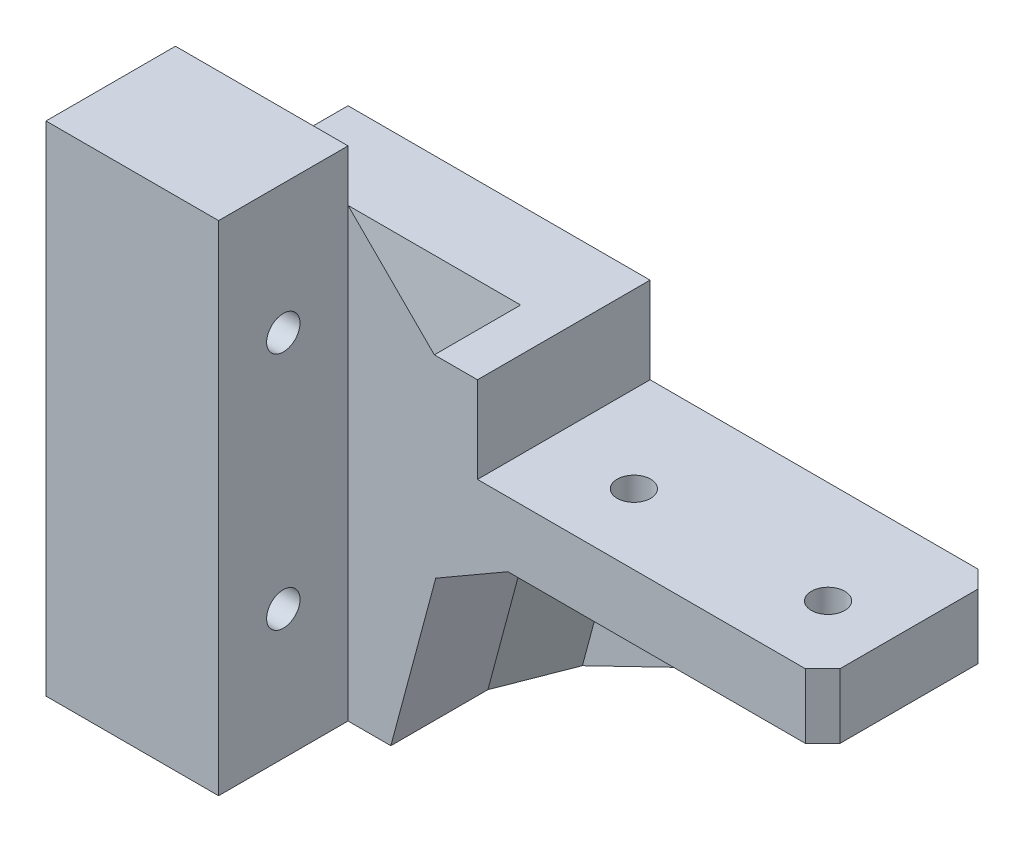
ISO-10303-21;
HEADER;
FILE_DESCRIPTION(('STEP AP214'),'2;1');
FILE_NAME('part.step','',(''),(''),'','','');
FILE_SCHEMA(('AUTOMOTIVE_DESIGN { 1 0 10303 214 1 1 1 1 }'));
ENDSEC;
DATA;
#1=APPLICATION_CONTEXT('core data for automotive mechanical design processes');
#2=APPLICATION_PROTOCOL_DEFINITION('international standard','automotive_design',2000,#1);
#3=PRODUCT_CONTEXT('',#1,'mechanical');
#4=PRODUCT('Part','Part','',(#3));
#5=PRODUCT_RELATED_PRODUCT_CATEGORY('part','',(#4));
#6=PRODUCT_DEFINITION_FORMATION('','',#4);
#7=PRODUCT_DEFINITION_CONTEXT('part definition',#1,'design');
#8=PRODUCT_DEFINITION('design','',#6,#7);
#9=PRODUCT_DEFINITION_SHAPE('','',#8);
#10=(LENGTH_UNIT() NAMED_UNIT(*) SI_UNIT(.MILLI.,.METRE.));
#11=(NAMED_UNIT(*) PLANE_ANGLE_UNIT() SI_UNIT($,.RADIAN.));
#12=(NAMED_UNIT(*) SI_UNIT($,.STERADIAN.) SOLID_ANGLE_UNIT());
#13=UNCERTAINTY_MEASURE_WITH_UNIT(LENGTH_MEASURE(1.E-05),#10,'distance_accuracy_value','');
#14=(GEOMETRIC_REPRESENTATION_CONTEXT(3) GLOBAL_UNCERTAINTY_ASSIGNED_CONTEXT((#13)) GLOBAL_UNIT_ASSIGNED_CONTEXT((#10,
#11,#12)) REPRESENTATION_CONTEXT('',''));
#15=CARTESIAN_POINT('',(0.,0.,0.));
#16=DIRECTION('',(0.,0.,1.));
#17=DIRECTION('',(1.,0.,0.));
#18=AXIS2_PLACEMENT_3D('',#15,#16,#17);
#19=CARTESIAN_POINT('',(95.2499999999948,-202.564999999986,-33.3374999999997));
#20=DIRECTION('',(0.,0.707106781186555,-0.707106781186544));
#21=DIRECTION('',(1.,0.,0.));
#22=AXIS2_PLACEMENT_3D('',#19,#20,#21);
#23=PLANE('',#22);
#24=CARTESIAN_POINT('',(85.7250000000001,-198.596249999989,-29.3687499999997));
#25=DIRECTION('',(0.,0.707106781186555,-0.707106781186544));
#26=DIRECTION('',(0.,0.707106781186547,0.707106781186554));
#27=AXIS2_PLACEMENT_3D('',#24,#25,#26);
#28=ELLIPSE('',#27,8.9802561210691,6.35);
#29=CARTESIAN_POINT('',(90.6819671612285,-202.564999999988,-33.3374999999996));
#30=VERTEX_POINT('',#29);
#31=CARTESIAN_POINT('',(80.7680328387726,-202.564999999991,-33.3374999999997));
#32=VERTEX_POINT('',#31);
#33=EDGE_CURVE('E173',#30,#32,#28,.T.);
#34=ORIENTED_EDGE('',*,*,#33,.T.);
#35=DIRECTION('',(1.,0.,0.));
#36=VECTOR('',#35,1.);
#37=CARTESIAN_POINT('',(95.2499999999948,-202.564999999986,-33.3374999999997));
#38=LINE('',#37,#36);
#39=CARTESIAN_POINT('',(62.1069671612249,-202.564999999988,-33.3374999999996));
#40=VERTEX_POINT('',#39);
#41=EDGE_CURVE('E180',#40,#32,#38,.T.);
#42=ORIENTED_EDGE('',*,*,#41,.F.);
#43=CARTESIAN_POINT('',(57.1499999999992,-198.596249999991,-29.3687499999997));
#44=DIRECTION('',(0.,0.707106781186555,-0.707106781186544));
#45=DIRECTION('',(0.,0.707106781186547,0.707106781186554));
#46=AXIS2_PLACEMENT_3D('',#43,#44,#45);
#47=ELLIPSE('',#46,8.98025612106912,6.35000000000001);
#48=CARTESIAN_POINT('',(52.1930328387673,-202.564999999983,-33.3374999999996));
#49=VERTEX_POINT('',#48);
#50=EDGE_CURVE('E394',#40,#49,#47,.T.);
#51=ORIENTED_EDGE('',*,*,#50,.T.);
#52=CARTESIAN_POINT('',(48.9302561210705,-202.564999999988,-33.3374999999997));
#53=VERTEX_POINT('',#52);
#54=EDGE_CURVE('E186',#53,#49,#38,.T.);
#55=ORIENTED_EDGE('',*,*,#54,.F.);
#56=DIRECTION('',(0.41596662095865,0.643028681416404,0.643028681416411));
#57=VECTOR('',#56,1.);
#58=CARTESIAN_POINT('',(48.9302561210705,-202.564999999988,-33.3374999999997));
#59=LINE('',#58,#57);
#60=CARTESIAN_POINT('',(44.8225263736655,-208.914999999988,-39.6875));
#61=VERTEX_POINT('',#60);
#62=EDGE_CURVE('E212',#61,#53,#59,.T.);
#63=ORIENTED_EDGE('',*,*,#62,.F.);
#64=DIRECTION('',(-1.,0.,0.));
#65=VECTOR('',#64,1.);
#66=CARTESIAN_POINT('',(0.,-208.914999999988,-39.6875));
#67=LINE('',#66,#65);
#68=CARTESIAN_POINT('',(82.1464607723961,-208.914999999991,-39.6875));
#69=VERTEX_POINT('',#68);
#70=EDGE_CURVE('E199',#69,#61,#67,.T.);
#71=ORIENTED_EDGE('',*,*,#70,.F.);
#72=DIRECTION('',(-0.824876446835016,-0.399736692997303,-0.399736692997308));
#73=VECTOR('',#72,1.);
#74=CARTESIAN_POINT('',(95.2499999999948,-202.564999999986,-33.3374999999997));
#75=LINE('',#74,#73);
#76=CARTESIAN_POINT('',(95.2499999999948,-202.564999999986,-33.3374999999997));
#77=VERTEX_POINT('',#76);
#78=EDGE_CURVE('E11',#77,#69,#75,.T.);
#79=ORIENTED_EDGE('',*,*,#78,.F.);
#80=EDGE_CURVE('E182',#30,#77,#38,.T.);
#81=ORIENTED_EDGE('',*,*,#80,.F.);
#82=EDGE_LOOP('',(#34,#42,#51,#55,#63,#71,#79,#81));
#83=FACE_BOUND('',#82,.T.);
#84=ADVANCED_FACE('F34',(#83),#23,.F.);
#85=CARTESIAN_POINT('',(25.399999999995,-160.055836743416,-44.4499999999994));
#86=DIRECTION('',(0.,1.,0.));
#87=DIRECTION('',(0.,0.,1.));
#88=AXIS2_PLACEMENT_3D('',#85,#86,#87);
#89=PLANE('',#88);
#90=DIRECTION('',(0.,0.,1.));
#91=VECTOR('',#90,1.);
#92=CARTESIAN_POINT('',(25.399999999995,-160.055836743416,-44.4499999999994));
#93=LINE('',#92,#91);
#94=CARTESIAN_POINT('',(25.399999999995,-160.055836743416,-19.0499999999992));
#95=VERTEX_POINT('',#94);
#96=CARTESIAN_POINT('',(25.399999999995,-160.055836743416,4.16333634234434E-13));
#97=VERTEX_POINT('',#96);
#98=EDGE_CURVE('E319',#95,#97,#93,.T.);
#99=ORIENTED_EDGE('',*,*,#98,.F.);
#100=DIRECTION('',(-1.,0.,0.));
#101=VECTOR('',#100,1.);
#102=CARTESIAN_POINT('',(60.3249999999998,-160.055836743416,-19.0499999999999));
#103=LINE('',#102,#101);
#104=CARTESIAN_POINT('',(-7.105427357601E-12,-160.055836743414,-19.0500000000001));
#105=VERTEX_POINT('',#104);
#106=EDGE_CURVE('E359',#95,#105,#103,.T.);
#107=ORIENTED_EDGE('',*,*,#106,.T.);
#108=DIRECTION('',(0.,0.,1.));
#109=VECTOR('',#108,1.);
#110=CARTESIAN_POINT('',(-7.99360577730113E-12,-160.055836743415,-44.4500000000002));
#111=LINE('',#110,#109);
#112=CARTESIAN_POINT('',(-7.06379399417756E-12,-160.055836743414,-1.2490009027033E-13));
#113=VERTEX_POINT('',#112);
#114=EDGE_CURVE('E317',#105,#113,#111,.T.);
#115=ORIENTED_EDGE('',*,*,#114,.T.);
#116=DIRECTION('',(-1.,0.,0.));
#117=VECTOR('',#116,1.);
#118=CARTESIAN_POINT('',(25.399999999995,-160.055836743416,4.16333634234434E-13));
#119=LINE('',#118,#117);
#120=EDGE_CURVE('E302',#97,#113,#119,.T.);
#121=ORIENTED_EDGE('',*,*,#120,.F.);
#122=EDGE_LOOP('',(#99,#107,#115,#121));
#123=FACE_BOUND('',#122,.T.);
#124=ADVANCED_FACE('F444',(#123),#89,.T.);
#125=CARTESIAN_POINT('',(31.6978347460993,-233.362499999999,-19.0499999999997));
#126=DIRECTION('',(0.965925826289074,-0.258819045102523,0.));
#127=DIRECTION('',(0.258819045102522,0.965925826289074,0.));
#128=AXIS2_PLACEMENT_3D('',#125,#126,#127);
#129=PLANE('',#128);
#130=DIRECTION('',(0.258819045102522,0.965925826289074,0.));
#131=VECTOR('',#130,1.);
#132=CARTESIAN_POINT('',(31.6978347460993,-233.362499999999,-33.3374999999997));
#133=LINE('',#132,#131);
#134=CARTESIAN_POINT('',(31.6978347460993,-233.362499999999,-33.3374999999997));
#135=VERTEX_POINT('',#134);
#136=CARTESIAN_POINT('',(38.3064990635998,-208.698628996924,-33.3374999999999));
#137=VERTEX_POINT('',#136);
#138=EDGE_CURVE('E195',#135,#137,#133,.T.);
#139=ORIENTED_EDGE('',*,*,#138,.T.);
#140=DIRECTION('',(0.,0.,1.));
#141=VECTOR('',#140,1.);
#142=CARTESIAN_POINT('',(38.3064990635998,-208.698628996924,-19.0499999999997));
#143=LINE('',#142,#141);
#144=CARTESIAN_POINT('',(38.3064990635998,-208.698628996924,-19.0499999999997));
#145=VERTEX_POINT('',#144);
#146=EDGE_CURVE('E197',#137,#145,#143,.T.);
#147=ORIENTED_EDGE('',*,*,#146,.T.);
#148=DIRECTION('',(-0.258819045102522,-0.965925826289069,0.));
#149=VECTOR('',#148,1.);
#150=CARTESIAN_POINT('',(31.6978347460993,-233.362499999999,-19.0499999999997));
#151=LINE('',#150,#149);
#152=CARTESIAN_POINT('',(31.6978347460993,-233.362499999999,-19.0499999999997));
#153=VERTEX_POINT('',#152);
#154=EDGE_CURVE('E349',#145,#153,#151,.T.);
#155=ORIENTED_EDGE('',*,*,#154,.T.);
#156=DIRECTION('',(0.,0.,-1.));
#157=VECTOR('',#156,1.);
#158=CARTESIAN_POINT('',(31.6978347460993,-233.362499999999,-19.0499999999997));
#159=LINE('',#158,#157);
#160=EDGE_CURVE('E290',#153,#135,#159,.T.);
#161=ORIENTED_EDGE('',*,*,#160,.T.);
#162=EDGE_LOOP('',(#139,#147,#155,#161));
#163=FACE_BOUND('',#162,.T.);
#164=ADVANCED_FACE('F448',(#163),#129,.T.);
#165=CARTESIAN_POINT('',(95.2499999999948,-202.564999999986,-19.0499999999997));
#166=DIRECTION('',(0.,-1.,0.));
#167=DIRECTION('',(0.,0.,-1.));
#168=AXIS2_PLACEMENT_3D('',#165,#166,#167);
#169=PLANE('',#168);
#170=CARTESIAN_POINT('',(85.7249999999983,-202.564999999991,-29.3687499999997));
#171=DIRECTION('',(0.,-1.,0.));
#172=DIRECTION('',(0.,0.,-1.));
#173=AXIS2_PLACEMENT_3D('',#170,#171,#172);
#174=CIRCLE('',#173,2.45744999999999);
#175=CARTESIAN_POINT('',(85.7249999999983,-202.564999999991,-31.8261999999997));
#176=VERTEX_POINT('',#175);
#177=EDGE_CURVE('E175',#176,#176,#174,.T.);
#178=ORIENTED_EDGE('',*,*,#177,.F.);
#179=EDGE_LOOP('',(#178));
#180=FACE_BOUND('',#179,.T.);
#181=CARTESIAN_POINT('',(57.1499999999992,-202.564999999992,-29.3687499999997));
#182=DIRECTION('',(0.,-1.,0.));
#183=DIRECTION('',(0.,0.,-1.));
#184=AXIS2_PLACEMENT_3D('',#181,#182,#183);
#185=CIRCLE('',#184,2.45744999999999);
#186=CARTESIAN_POINT('',(57.1499999999992,-202.564999999992,-31.8261999999996));
#187=VERTEX_POINT('',#186);
#188=EDGE_CURVE('E388',#187,#187,#185,.T.);
#189=ORIENTED_EDGE('',*,*,#188,.F.);
#190=EDGE_LOOP('',(#189));
#191=FACE_BOUND('',#190,.T.);
#192=DIRECTION('',(-1.,0.,0.));
#193=VECTOR('',#192,1.);
#194=CARTESIAN_POINT('',(95.2499999999948,-202.564999999986,-19.0499999999997));
#195=LINE('',#194,#193);
#196=CARTESIAN_POINT('',(92.7100000000003,-202.564999999989,-19.0499999999997));
#197=VERTEX_POINT('',#196);
#198=CARTESIAN_POINT('',(48.9302561210705,-202.564999999988,-19.0499999999997));
#199=VERTEX_POINT('',#198);
#200=EDGE_CURVE('E270',#197,#199,#195,.T.);
#201=ORIENTED_EDGE('',*,*,#200,.T.);
#202=DIRECTION('',(0.,0.,-1.));
#203=VECTOR('',#202,1.);
#204=CARTESIAN_POINT('',(48.9302561210705,-202.564999999988,-39.6874999999997));
#205=LINE('',#204,#203);
#206=EDGE_CURVE('E188',#199,#53,#205,.T.);
#207=ORIENTED_EDGE('',*,*,#206,.T.);
#208=ORIENTED_EDGE('',*,*,#54,.T.);
#209=CARTESIAN_POINT('',(57.1499999999992,-202.564999999992,-29.3687499999997));
#210=DIRECTION('',(0.,-1.,0.));
#211=DIRECTION('',(0.,0.,-1.));
#212=AXIS2_PLACEMENT_3D('',#209,#210,#211);
#213=CIRCLE('',#212,6.35000000000001);
#214=EDGE_CURVE('E56',#49,#40,#213,.T.);
#215=ORIENTED_EDGE('',*,*,#214,.T.);
#216=ORIENTED_EDGE('',*,*,#41,.T.);
#217=CARTESIAN_POINT('',(85.7249999999983,-202.564999999991,-29.3687499999997));
#218=DIRECTION('',(0.,-1.,0.));
#219=DIRECTION('',(0.,0.,-1.));
#220=AXIS2_PLACEMENT_3D('',#217,#218,#219);
#221=CIRCLE('',#220,6.35);
#222=EDGE_CURVE('E50',#32,#30,#221,.T.);
#223=ORIENTED_EDGE('',*,*,#222,.T.);
#224=ORIENTED_EDGE('',*,*,#80,.T.);
#225=DIRECTION('',(0.,0.,-1.));
#226=VECTOR('',#225,1.);
#227=CARTESIAN_POINT('',(95.2499999999948,-202.564999999986,-19.0499999999997));
#228=LINE('',#227,#226);
#229=CARTESIAN_POINT('',(95.2499999999948,-202.564999999986,-21.5899999999997));
#230=VERTEX_POINT('',#229);
#231=EDGE_CURVE('E287',#230,#77,#228,.T.);
#232=ORIENTED_EDGE('',*,*,#231,.F.);
#233=DIRECTION('',(-0.707106781186551,0.,0.707106781186546));
#234=VECTOR('',#233,1.);
#235=CARTESIAN_POINT('',(93.9800000000002,-202.564999999989,-20.3199999999996));
#236=LINE('',#235,#234);
#237=EDGE_CURVE('E259',#230,#197,#236,.T.);
#238=ORIENTED_EDGE('',*,*,#237,.T.);
#239=EDGE_LOOP('',(#201,#207,#208,#215,#216,#223,#224,#232,#238));
#240=FACE_BOUND('',#239,.T.);
#241=ADVANCED_FACE('F185',(#180,#191,#240),#169,.T.);
#242=CARTESIAN_POINT('',(25.399999999995,-160.055836743416,-44.4499999999994));
#243=DIRECTION('',(1.,0.,0.));
#244=DIRECTION('',(0.,1.00000000000001,0.));
#245=AXIS2_PLACEMENT_3D('',#242,#243,#244);
#246=PLANE('',#245);
#247=CARTESIAN_POINT('',(25.3999999999968,-214.312500000006,-9.52499999999992));
#248=DIRECTION('',(1.,0.,0.));
#249=DIRECTION('',(0.,1.00000000000001,0.));
#250=AXIS2_PLACEMENT_3D('',#247,#248,#249);
#251=CIRCLE('',#250,2.45744999999999);
#252=CARTESIAN_POINT('',(25.3999999999968,-211.855050000006,-9.52499999999992));
#253=VERTEX_POINT('',#252);
#254=EDGE_CURVE('E220',#253,#253,#251,.T.);
#255=ORIENTED_EDGE('',*,*,#254,.F.);
#256=EDGE_LOOP('',(#255));
#257=FACE_BOUND('',#256,.T.);
#258=CARTESIAN_POINT('',(25.3999999999977,-179.105836743419,-9.52499999999973));
#259=DIRECTION('',(1.,0.,0.));
#260=DIRECTION('',(0.,1.00000000000001,0.));
#261=AXIS2_PLACEMENT_3D('',#258,#259,#260);
#262=CIRCLE('',#261,2.45744999999999);
#263=CARTESIAN_POINT('',(25.3999999999977,-176.648386743419,-9.52499999999973));
#264=VERTEX_POINT('',#263);
#265=EDGE_CURVE('E383',#264,#264,#262,.T.);
#266=ORIENTED_EDGE('',*,*,#265,.F.);
#267=EDGE_LOOP('',(#266));
#268=FACE_BOUND('',#267,.T.);
#269=DIRECTION('',(0.,1.00000000000001,0.));
#270=VECTOR('',#269,1.);
#271=CARTESIAN_POINT('',(25.4000000000012,-233.3625,-19.0499999999999));
#272=LINE('',#271,#270);
#273=CARTESIAN_POINT('',(25.4000000000012,-233.3625,-19.0499999999999));
#274=VERTEX_POINT('',#273);
#275=CARTESIAN_POINT('',(25.4000000000004,-167.639999999989,-19.0499999999996));
#276=VERTEX_POINT('',#275);
#277=EDGE_CURVE('E343',#274,#276,#272,.T.);
#278=ORIENTED_EDGE('',*,*,#277,.T.);
#279=EDGE_CURVE('E345',#276,#95,#272,.T.);
#280=ORIENTED_EDGE('',*,*,#279,.T.);
#281=ORIENTED_EDGE('',*,*,#98,.T.);
#282=DIRECTION('',(0.,1.00000000000001,0.));
#283=VECTOR('',#282,1.);
#284=CARTESIAN_POINT('',(25.399999999995,-160.055836743416,4.16333634234434E-13));
#285=LINE('',#284,#283);
#286=CARTESIAN_POINT('',(25.4000000000003,-233.362500000002,1.80411241501588E-13));
#287=VERTEX_POINT('',#286);
#288=EDGE_CURVE('E312',#287,#97,#285,.T.);
#289=ORIENTED_EDGE('',*,*,#288,.F.);
#290=DIRECTION('',(0.,0.,1.));
#291=VECTOR('',#290,1.);
#292=CARTESIAN_POINT('',(25.4000000000013,-233.3625,-44.4499999999999));
#293=LINE('',#292,#291);
#294=EDGE_CURVE('E321',#274,#287,#293,.T.);
#295=ORIENTED_EDGE('',*,*,#294,.F.);
#296=EDGE_LOOP('',(#278,#280,#281,#289,#295));
#297=FACE_BOUND('',#296,.T.);
#298=ADVANCED_FACE('F461',(#257,#268,#297),#246,.T.);
#299=CARTESIAN_POINT('',(-7.99360577730113E-12,-160.055836743415,-44.4500000000002));
#300=DIRECTION('',(-1.,0.,0.));
#301=DIRECTION('',(0.,-1.,0.));
#302=AXIS2_PLACEMENT_3D('',#299,#300,#301);
#303=PLANE('',#302);
#304=CARTESIAN_POINT('',(0.,-179.105836743417,-9.52499999999958));
#305=DIRECTION('',(-1.,0.,0.));
#306=DIRECTION('',(0.,0.,1.));
#307=AXIS2_PLACEMENT_3D('',#304,#305,#306);
#308=CIRCLE('',#307,2.95910000000002);
#309=CARTESIAN_POINT('',(0.,-179.105836743417,-6.56589999999955));
#310=VERTEX_POINT('',#309);
#311=EDGE_CURVE('E380',#310,#310,#308,.T.);
#312=ORIENTED_EDGE('',*,*,#311,.F.);
#313=EDGE_LOOP('',(#312));
#314=FACE_BOUND('',#313,.T.);
#315=CARTESIAN_POINT('',(-8.18789480661053E-13,-214.312500000005,-9.52499999999992));
#316=DIRECTION('',(-1.,0.,0.));
#317=DIRECTION('',(0.,0.,1.));
#318=AXIS2_PLACEMENT_3D('',#315,#316,#317);
#319=CIRCLE('',#318,2.95910000000002);
#320=CARTESIAN_POINT('',(-8.18132428470619E-13,-214.312500000005,-6.5658999999999));
#321=VERTEX_POINT('',#320);
#322=EDGE_CURVE('E374',#321,#321,#319,.T.);
#323=ORIENTED_EDGE('',*,*,#322,.F.);
#324=EDGE_LOOP('',(#323));
#325=FACE_BOUND('',#324,.T.);
#326=DIRECTION('',(0.,-1.,0.));
#327=VECTOR('',#326,1.);
#328=CARTESIAN_POINT('',(-7.04991620636974E-12,-180.339999999986,-19.0499999999997));
#329=LINE('',#328,#327);
#330=CARTESIAN_POINT('',(-3.52495810318487E-12,-167.639999999986,-19.05));
#331=VERTEX_POINT('',#330);
#332=EDGE_CURVE('E364',#105,#331,#329,.T.);
#333=ORIENTED_EDGE('',*,*,#332,.T.);
#334=DIRECTION('',(0.,-0.707106781186547,-0.707106781186552));
#335=VECTOR('',#334,1.);
#336=CARTESIAN_POINT('',(-7.06379399417756E-12,-180.339999999986,-31.7499999999999));
#337=LINE('',#336,#335);
#338=CARTESIAN_POINT('',(-7.07767178198537E-12,-180.339999999986,-31.7499999999998));
#339=VERTEX_POINT('',#338);
#340=EDGE_CURVE('E235',#331,#339,#337,.T.);
#341=ORIENTED_EDGE('',*,*,#340,.T.);
#342=DIRECTION('',(0.,0.,-1.));
#343=VECTOR('',#342,1.);
#344=CARTESIAN_POINT('',(-7.06379399417756E-12,-180.339999999986,44.5939541827765));
#345=LINE('',#344,#343);
#346=CARTESIAN_POINT('',(-7.07767178198537E-12,-180.339999999986,-44.4499999999998));
#347=VERTEX_POINT('',#346);
#348=EDGE_CURVE('E362',#339,#347,#345,.T.);
#349=ORIENTED_EDGE('',*,*,#348,.T.);
#350=DIRECTION('',(0.,-1.,0.));
#351=VECTOR('',#350,1.);
#352=CARTESIAN_POINT('',(-7.99360577730113E-12,-160.055836743415,-44.4500000000002));
#353=LINE('',#352,#351);
#354=CARTESIAN_POINT('',(0.,-233.3625,-44.4499999999998));
#355=VERTEX_POINT('',#354);
#356=EDGE_CURVE('E299',#347,#355,#353,.T.);
#357=ORIENTED_EDGE('',*,*,#356,.T.);
#358=DIRECTION('',(0.,0.,1.));
#359=VECTOR('',#358,1.);
#360=CARTESIAN_POINT('',(0.,-233.3625,-44.4499999999998));
#361=LINE('',#360,#359);
#362=CARTESIAN_POINT('',(0.,-233.3625,2.91433543964104E-13));
#363=VERTEX_POINT('',#362);
#364=EDGE_CURVE('E305',#355,#363,#361,.T.);
#365=ORIENTED_EDGE('',*,*,#364,.T.);
#366=DIRECTION('',(0.,-1.,0.));
#367=VECTOR('',#366,1.);
#368=CARTESIAN_POINT('',(-7.06379399417756E-12,-160.055836743414,-1.2490009027033E-13));
#369=LINE('',#368,#367);
#370=EDGE_CURVE('E306',#113,#363,#369,.T.);
#371=ORIENTED_EDGE('',*,*,#370,.F.);
#372=ORIENTED_EDGE('',*,*,#114,.F.);
#373=EDGE_LOOP('',(#333,#341,#349,#357,#365,#371,#372));
#374=FACE_BOUND('',#373,.T.);
#375=ADVANCED_FACE('F464',(#314,#325,#374),#303,.T.);
#376=CARTESIAN_POINT('',(25.4000000000013,-233.3625,-44.4499999999999));
#377=DIRECTION('',(0.,-1.,0.));
#378=DIRECTION('',(0.,0.,-1.));
#379=AXIS2_PLACEMENT_3D('',#376,#377,#378);
#380=PLANE('',#379);
#381=DIRECTION('',(1.,0.,0.));
#382=VECTOR('',#381,1.);
#383=CARTESIAN_POINT('',(25.4000000000003,-233.362500000002,1.80411241501588E-13));
#384=LINE('',#383,#382);
#385=EDGE_CURVE('E309',#363,#287,#384,.T.);
#386=ORIENTED_EDGE('',*,*,#385,.F.);
#387=ORIENTED_EDGE('',*,*,#364,.F.);
#388=DIRECTION('',(1.,0.,0.));
#389=VECTOR('',#388,1.);
#390=CARTESIAN_POINT('',(25.4000000000013,-233.3625,-44.4499999999999));
#391=LINE('',#390,#389);
#392=CARTESIAN_POINT('',(31.6978347460993,-233.362499999999,-44.4499999999998));
#393=VERTEX_POINT('',#392);
#394=EDGE_CURVE('E301',#355,#393,#391,.T.);
#395=ORIENTED_EDGE('',*,*,#394,.T.);
#396=DIRECTION('',(0.,0.,-1.));
#397=VECTOR('',#396,1.);
#398=CARTESIAN_POINT('',(31.6978347460993,-233.362499999999,-39.6874999999998));
#399=LINE('',#398,#397);
#400=EDGE_CURVE('E352',#135,#393,#399,.T.);
#401=ORIENTED_EDGE('',*,*,#400,.F.);
#402=ORIENTED_EDGE('',*,*,#160,.F.);
#403=DIRECTION('',(-1.,0.,0.));
#404=VECTOR('',#403,1.);
#405=CARTESIAN_POINT('',(25.4000000000012,-233.3625,-19.0499999999999));
#406=LINE('',#405,#404);
#407=EDGE_CURVE('E346',#153,#274,#406,.T.);
#408=ORIENTED_EDGE('',*,*,#407,.T.);
#409=ORIENTED_EDGE('',*,*,#294,.T.);
#410=EDGE_LOOP('',(#386,#387,#395,#401,#402,#408,#409));
#411=FACE_BOUND('',#410,.T.);
#412=ADVANCED_FACE('F466',(#411),#380,.T.);
#413=CARTESIAN_POINT('',(0.,0.,-44.45));
#414=DIRECTION('',(0.,0.,-1.));
#415=DIRECTION('',(-1.,0.,0.));
#416=AXIS2_PLACEMENT_3D('',#413,#414,#415);
#417=PLANE('',#416);
#418=DIRECTION('',(1.,0.,0.));
#419=VECTOR('',#418,1.);
#420=CARTESIAN_POINT('',(44.4500000000004,-193.039999999989,-44.4499999999997));
#421=LINE('',#420,#419);
#422=CARTESIAN_POINT('',(44.4500000000004,-193.039999999989,-44.4499999999997));
#423=VERTEX_POINT('',#422);
#424=CARTESIAN_POINT('',(92.7099999999995,-193.039999999988,-44.4499999999997));
#425=VERTEX_POINT('',#424);
#426=EDGE_CURVE('E338',#423,#425,#421,.T.);
#427=ORIENTED_EDGE('',*,*,#426,.T.);
#428=DIRECTION('',(0.,-1.,0.));
#429=VECTOR('',#428,1.);
#430=CARTESIAN_POINT('',(92.7099999999995,1.66533453693773E-13,-44.4499999999994));
#431=LINE('',#430,#429);
#432=CARTESIAN_POINT('',(92.7100000000004,-203.795888824745,-44.4499999999998));
#433=VERTEX_POINT('',#432);
#434=EDGE_CURVE('E246',#425,#433,#431,.T.);
#435=ORIENTED_EDGE('',*,*,#434,.T.);
#436=DIRECTION('',(-0.89990120040365,-0.436093831086931,0.));
#437=VECTOR('',#436,1.);
#438=CARTESIAN_POINT('',(31.6978347460993,-233.362499999999,-44.4499999999998));
#439=LINE('',#438,#437);
#440=EDGE_CURVE('E357',#433,#393,#439,.T.);
#441=ORIENTED_EDGE('',*,*,#440,.T.);
#442=ORIENTED_EDGE('',*,*,#394,.F.);
#443=ORIENTED_EDGE('',*,*,#356,.F.);
#444=DIRECTION('',(-1.,0.,0.));
#445=VECTOR('',#444,1.);
#446=CARTESIAN_POINT('',(60.3249999999971,-180.339999999987,-44.4499999999998));
#447=LINE('',#446,#445);
#448=CARTESIAN_POINT('',(44.4499999999986,-180.339999999986,-44.4499999999997));
#449=VERTEX_POINT('',#448);
#450=EDGE_CURVE('E365',#449,#347,#447,.T.);
#451=ORIENTED_EDGE('',*,*,#450,.F.);
#452=DIRECTION('',(0.,-1.,0.));
#453=VECTOR('',#452,1.);
#454=CARTESIAN_POINT('',(44.4500000000004,-193.039999999989,-44.4499999999997));
#455=LINE('',#454,#453);
#456=EDGE_CURVE('E279',#449,#423,#455,.T.);
#457=ORIENTED_EDGE('',*,*,#456,.T.);
#458=EDGE_LOOP('',(#427,#435,#441,#442,#443,#451,#457));
#459=FACE_BOUND('',#458,.T.);
#460=ADVANCED_FACE('F421',(#459),#417,.T.);
#461=CARTESIAN_POINT('',(0.,0.,0.));
#462=DIRECTION('',(0.,0.,-1.));
#463=DIRECTION('',(-1.,0.,0.));
#464=AXIS2_PLACEMENT_3D('',#461,#462,#463);
#465=PLANE('',#464);
#466=ORIENTED_EDGE('',*,*,#370,.T.);
#467=ORIENTED_EDGE('',*,*,#385,.T.);
#468=ORIENTED_EDGE('',*,*,#288,.T.);
#469=ORIENTED_EDGE('',*,*,#120,.T.);
#470=EDGE_LOOP('',(#466,#467,#468,#469));
#471=FACE_BOUND('',#470,.T.);
#472=ADVANCED_FACE('F459',(#471),#465,.F.);
#473=CARTESIAN_POINT('',(44.4500000000004,-193.039999999989,-19.0499999999997));
#474=DIRECTION('',(0.,1.,0.));
#475=DIRECTION('',(0.,0.,1.));
#476=AXIS2_PLACEMENT_3D('',#473,#474,#475);
#477=PLANE('',#476);
#478=CARTESIAN_POINT('',(85.724999999993,-193.039999999987,-29.3687499999997));
#479=DIRECTION('',(0.,1.,0.));
#480=DIRECTION('',(0.,0.,1.));
#481=AXIS2_PLACEMENT_3D('',#478,#479,#480);
#482=CIRCLE('',#481,2.45744999999999);
#483=CARTESIAN_POINT('',(85.724999999993,-193.039999999987,-26.9112999999997));
#484=VERTEX_POINT('',#483);
#485=EDGE_CURVE('E37',#484,#484,#482,.T.);
#486=ORIENTED_EDGE('',*,*,#485,.F.);
#487=EDGE_LOOP('',(#486));
#488=FACE_BOUND('',#487,.T.);
#489=CARTESIAN_POINT('',(57.1499999999859,-193.039999999986,-29.3687499999997));
#490=DIRECTION('',(0.,1.,0.));
#491=DIRECTION('',(0.,0.,1.));
#492=AXIS2_PLACEMENT_3D('',#489,#490,#491);
#493=CIRCLE('',#492,2.45744999999999);
#494=CARTESIAN_POINT('',(57.1499999999859,-193.039999999986,-26.9112999999997));
#495=VERTEX_POINT('',#494);
#496=EDGE_CURVE('E210',#495,#495,#493,.T.);
#497=ORIENTED_EDGE('',*,*,#496,.F.);
#498=EDGE_LOOP('',(#497));
#499=FACE_BOUND('',#498,.T.);
#500=DIRECTION('',(0.,0.,-1.));
#501=VECTOR('',#500,1.);
#502=CARTESIAN_POINT('',(95.2499999999921,-193.039999999989,-19.0499999999996));
#503=LINE('',#502,#501);
#504=CARTESIAN_POINT('',(95.2499999999921,-193.039999999989,-21.5899999999995));
#505=VERTEX_POINT('',#504);
#506=CARTESIAN_POINT('',(95.2499999999921,-193.039999999989,-41.9099999999995));
#507=VERTEX_POINT('',#506);
#508=EDGE_CURVE('E288',#505,#507,#503,.T.);
#509=ORIENTED_EDGE('',*,*,#508,.T.);
#510=DIRECTION('',(0.707106781186546,0.,0.707106781186553));
#511=VECTOR('',#510,1.);
#512=CARTESIAN_POINT('',(81.2799999999996,-193.039999999989,-55.8799999999999));
#513=LINE('',#512,#511);
#514=EDGE_CURVE('E258',#507,#425,#513,.F.);
#515=ORIENTED_EDGE('',*,*,#514,.T.);
#516=ORIENTED_EDGE('',*,*,#426,.F.);
#517=DIRECTION('',(0.,0.,-1.));
#518=VECTOR('',#517,1.);
#519=CARTESIAN_POINT('',(44.4500000000004,-193.039999999989,-19.0499999999997));
#520=LINE('',#519,#518);
#521=CARTESIAN_POINT('',(44.4500000000004,-193.039999999989,-19.0499999999997));
#522=VERTEX_POINT('',#521);
#523=EDGE_CURVE('E278',#522,#423,#520,.T.);
#524=ORIENTED_EDGE('',*,*,#523,.F.);
#525=DIRECTION('',(1.,0.,0.));
#526=VECTOR('',#525,1.);
#527=CARTESIAN_POINT('',(44.4500000000004,-193.039999999989,-19.0499999999997));
#528=LINE('',#527,#526);
#529=CARTESIAN_POINT('',(92.7099999999995,-193.039999999988,-19.0499999999996));
#530=VERTEX_POINT('',#529);
#531=EDGE_CURVE('E268',#522,#530,#528,.T.);
#532=ORIENTED_EDGE('',*,*,#531,.T.);
#533=DIRECTION('',(0.707106781186551,0.,-0.707106781186546));
#534=VECTOR('',#533,1.);
#535=CARTESIAN_POINT('',(68.5799999999972,-193.039999999989,5.08000000000035));
#536=LINE('',#535,#534);
#537=EDGE_CURVE('E256',#530,#505,#536,.T.);
#538=ORIENTED_EDGE('',*,*,#537,.T.);
#539=EDGE_LOOP('',(#509,#515,#516,#524,#532,#538));
#540=FACE_BOUND('',#539,.T.);
#541=ADVANCED_FACE('F275',(#488,#499,#540),#477,.T.);
#542=CARTESIAN_POINT('',(44.4500000000004,-193.039999999989,-19.0499999999997));
#543=DIRECTION('',(1.,0.,0.));
#544=DIRECTION('',(0.,1.,0.));
#545=AXIS2_PLACEMENT_3D('',#542,#543,#544);
#546=PLANE('',#545);
#547=ORIENTED_EDGE('',*,*,#456,.F.);
#548=DIRECTION('',(0.,0.,-1.));
#549=VECTOR('',#548,1.);
#550=CARTESIAN_POINT('',(44.4499999999986,-180.339999999986,-19.0499999999997));
#551=LINE('',#550,#549);
#552=CARTESIAN_POINT('',(44.4499999999986,-180.339999999986,-19.0499999999997));
#553=VERTEX_POINT('',#552);
#554=EDGE_CURVE('E293',#553,#449,#551,.T.);
#555=ORIENTED_EDGE('',*,*,#554,.F.);
#556=DIRECTION('',(0.,-1.,0.));
#557=VECTOR('',#556,1.);
#558=CARTESIAN_POINT('',(44.4500000000004,-193.039999999989,-19.0499999999997));
#559=LINE('',#558,#557);
#560=EDGE_CURVE('E295',#553,#522,#559,.T.);
#561=ORIENTED_EDGE('',*,*,#560,.T.);
#562=ORIENTED_EDGE('',*,*,#523,.T.);
#563=EDGE_LOOP('',(#547,#555,#561,#562));
#564=FACE_BOUND('',#563,.T.);
#565=ADVANCED_FACE('F333',(#564),#546,.T.);
#566=CARTESIAN_POINT('',(95.2499999999921,-193.039999999989,-19.0499999999996));
#567=DIRECTION('',(1.,0.,0.));
#568=DIRECTION('',(0.,0.,-1.));
#569=AXIS2_PLACEMENT_3D('',#566,#567,#568);
#570=PLANE('',#569);
#571=DIRECTION('',(0.,0.,-1.));
#572=VECTOR('',#571,1.);
#573=CARTESIAN_POINT('',(95.2499999999948,-202.564999999986,-39.6874999999997));
#574=LINE('',#573,#572);
#575=CARTESIAN_POINT('',(95.2499999999948,-202.564999999986,-41.9099999999997));
#576=VERTEX_POINT('',#575);
#577=EDGE_CURVE('E341',#77,#576,#574,.T.);
#578=ORIENTED_EDGE('',*,*,#577,.T.);
#579=DIRECTION('',(0.,1.,0.));
#580=VECTOR('',#579,1.);
#581=CARTESIAN_POINT('',(95.2499999999921,-193.039999999989,-41.9099999999995));
#582=LINE('',#581,#580);
#583=EDGE_CURVE('E254',#576,#507,#582,.T.);
#584=ORIENTED_EDGE('',*,*,#583,.T.);
#585=ORIENTED_EDGE('',*,*,#508,.F.);
#586=DIRECTION('',(0.,-1.,0.));
#587=VECTOR('',#586,1.);
#588=CARTESIAN_POINT('',(95.2499999999948,-202.564999999986,-21.5899999999997));
#589=LINE('',#588,#587);
#590=EDGE_CURVE('E251',#505,#230,#589,.T.);
#591=ORIENTED_EDGE('',*,*,#590,.T.);
#592=ORIENTED_EDGE('',*,*,#231,.T.);
#593=EDGE_LOOP('',(#578,#584,#585,#591,#592));
#594=FACE_BOUND('',#593,.T.);
#595=ADVANCED_FACE('F286',(#594),#570,.T.);
#596=CARTESIAN_POINT('',(0.,0.,-19.05));
#597=DIRECTION('',(0.,0.,-1.));
#598=DIRECTION('',(-1.,0.,0.));
#599=AXIS2_PLACEMENT_3D('',#596,#597,#598);
#600=PLANE('',#599);
#601=ORIENTED_EDGE('',*,*,#200,.F.);
#602=DIRECTION('',(0.,1.,0.));
#603=VECTOR('',#602,1.);
#604=CARTESIAN_POINT('',(92.7099999999995,-193.039999999988,-19.0499999999996));
#605=LINE('',#604,#603);
#606=EDGE_CURVE('E189',#197,#530,#605,.T.);
#607=ORIENTED_EDGE('',*,*,#606,.T.);
#608=ORIENTED_EDGE('',*,*,#531,.F.);
#609=ORIENTED_EDGE('',*,*,#560,.F.);
#610=DIRECTION('',(-1.,0.,0.));
#611=VECTOR('',#610,1.);
#612=CARTESIAN_POINT('',(-7.04991620636974E-12,-180.339999999986,-19.0499999999997));
#613=LINE('',#612,#611);
#614=CARTESIAN_POINT('',(38.0999999999903,-180.339999999991,-19.0499999999996));
#615=VERTEX_POINT('',#614);
#616=EDGE_CURVE('E233',#553,#615,#613,.T.);
#617=ORIENTED_EDGE('',*,*,#616,.T.);
#618=DIRECTION('',(-0.707106781186555,0.707106781186548,0.));
#619=VECTOR('',#618,1.);
#620=CARTESIAN_POINT('',(-71.1199999999952,-71.1199999999953,-19.05));
#621=LINE('',#620,#619);
#622=EDGE_CURVE('E240',#615,#276,#621,.T.);
#623=ORIENTED_EDGE('',*,*,#622,.T.);
#624=ORIENTED_EDGE('',*,*,#277,.F.);
#625=ORIENTED_EDGE('',*,*,#407,.F.);
#626=ORIENTED_EDGE('',*,*,#154,.F.);
#627=DIRECTION('',(-0.866025403784444,-0.499999999999996,0.));
#628=VECTOR('',#627,1.);
#629=CARTESIAN_POINT('',(99.9457819890504,-173.111172407252,-19.05));
#630=LINE('',#629,#628);
#631=EDGE_CURVE('E203',#145,#199,#630,.F.);
#632=ORIENTED_EDGE('',*,*,#631,.T.);
#633=EDGE_LOOP('',(#601,#607,#608,#609,#617,#623,#624,#625,#626,#632));
#634=FACE_BOUND('',#633,.T.);
#635=ADVANCED_FACE('F266',(#634),#600,.F.);
#636=CARTESIAN_POINT('',(31.6978347460993,-233.362499999999,-39.6874999999998));
#637=DIRECTION('',(0.436093831086932,-0.899901200403649,0.));
#638=DIRECTION('',(0.89990120040365,0.43609383108693,0.));
#639=AXIS2_PLACEMENT_3D('',#636,#637,#638);
#640=PLANE('',#639);
#641=ORIENTED_EDGE('',*,*,#440,.F.);
#642=DIRECTION('',(-0.668924155615004,-0.324161916439151,-0.668924155615011));
#643=VECTOR('',#642,1.);
#644=CARTESIAN_POINT('',(61.1293352811338,-219.099938935295,-76.0306647188665));
#645=LINE('',#644,#643);
#646=EDGE_CURVE('E249',#433,#576,#645,.F.);
#647=ORIENTED_EDGE('',*,*,#646,.T.);
#648=ORIENTED_EDGE('',*,*,#577,.F.);
#649=ORIENTED_EDGE('',*,*,#78,.T.);
#650=DIRECTION('',(-0.89990120040365,-0.436093831086931,0.));
#651=VECTOR('',#650,1.);
#652=CARTESIAN_POINT('',(31.6978347460993,-233.362499999999,-39.6874999999998));
#653=LINE('',#652,#651);
#654=CARTESIAN_POINT('',(39.2528469056011,-229.701326756685,-39.6874999999993));
#655=VERTEX_POINT('',#654);
#656=EDGE_CURVE('E355',#69,#655,#653,.T.);
#657=ORIENTED_EDGE('',*,*,#656,.T.);
#658=DIRECTION('',(-0.717721056951783,-0.347808987517153,0.603245714953957));
#659=VECTOR('',#658,1.);
#660=CARTESIAN_POINT('',(31.6978347460993,-233.362499999999,-33.3374999999997));
#661=LINE('',#660,#659);
#662=EDGE_CURVE('E42',#655,#135,#661,.T.);
#663=ORIENTED_EDGE('',*,*,#662,.T.);
#664=ORIENTED_EDGE('',*,*,#400,.T.);
#665=EDGE_LOOP('',(#641,#647,#648,#649,#657,#663,#664));
#666=FACE_BOUND('',#665,.T.);
#667=ADVANCED_FACE('F414',(#666),#640,.T.);
#668=CARTESIAN_POINT('',(0.,0.,-39.6874999999999));
#669=DIRECTION('',(0.,0.,-1.));
#670=DIRECTION('',(-1.,0.,0.));
#671=AXIS2_PLACEMENT_3D('',#668,#669,#670);
#672=PLANE('',#671);
#673=ORIENTED_EDGE('',*,*,#70,.T.);
#674=DIRECTION('',(-0.258819045102522,-0.965925826289074,0.));
#675=VECTOR('',#674,1.);
#676=CARTESIAN_POINT('',(94.0487364375287,-25.2002829776022,-39.6874999999994));
#677=LINE('',#676,#675);
#678=EDGE_CURVE('E201',#61,#655,#677,.T.);
#679=ORIENTED_EDGE('',*,*,#678,.T.);
#680=ORIENTED_EDGE('',*,*,#656,.F.);
#681=EDGE_LOOP('',(#673,#679,#680));
#682=FACE_BOUND('',#681,.T.);
#683=ADVANCED_FACE('F411',(#682),#672,.F.);
#684=CARTESIAN_POINT('',(60.3249999999971,-180.339999999986,44.5939541827764));
#685=DIRECTION('',(0.,-1.,0.));
#686=DIRECTION('',(0.,0.,-1.));
#687=AXIS2_PLACEMENT_3D('',#684,#685,#686);
#688=PLANE('',#687);
#689=DIRECTION('',(1.,0.,0.));
#690=VECTOR('',#689,1.);
#691=CARTESIAN_POINT('',(60.3249999999971,-180.339999999986,-31.7499999999998));
#692=LINE('',#691,#690);
#693=CARTESIAN_POINT('',(38.0999999999903,-180.339999999991,-31.7499999999997));
#694=VERTEX_POINT('',#693);
#695=EDGE_CURVE('E230',#339,#694,#692,.T.);
#696=ORIENTED_EDGE('',*,*,#695,.T.);
#697=DIRECTION('',(0.,0.,1.));
#698=VECTOR('',#697,1.);
#699=CARTESIAN_POINT('',(38.0999999999903,-180.339999999991,44.5939541827764));
#700=LINE('',#699,#698);
#701=EDGE_CURVE('E237',#694,#615,#700,.T.);
#702=ORIENTED_EDGE('',*,*,#701,.T.);
#703=ORIENTED_EDGE('',*,*,#616,.F.);
#704=ORIENTED_EDGE('',*,*,#554,.T.);
#705=ORIENTED_EDGE('',*,*,#450,.T.);
#706=ORIENTED_EDGE('',*,*,#348,.F.);
#707=EDGE_LOOP('',(#696,#702,#703,#704,#705,#706));
#708=FACE_BOUND('',#707,.T.);
#709=ADVANCED_FACE('F327',(#708),#688,.F.);
#710=CARTESIAN_POINT('',(0.,0.,-19.05));
#711=DIRECTION('',(0.,0.,-1.));
#712=DIRECTION('',(-1.,0.,0.));
#713=AXIS2_PLACEMENT_3D('',#710,#711,#712);
#714=PLANE('',#713);
#715=ORIENTED_EDGE('',*,*,#279,.F.);
#716=DIRECTION('',(-1.,0.,0.));
#717=VECTOR('',#716,1.);
#718=CARTESIAN_POINT('',(-3.52495810318487E-12,-167.639999999986,-19.05));
#719=LINE('',#718,#717);
#720=EDGE_CURVE('E232',#276,#331,#719,.T.);
#721=ORIENTED_EDGE('',*,*,#720,.T.);
#722=ORIENTED_EDGE('',*,*,#332,.F.);
#723=ORIENTED_EDGE('',*,*,#106,.F.);
#724=EDGE_LOOP('',(#715,#721,#722,#723));
#725=FACE_BOUND('',#724,.T.);
#726=ADVANCED_FACE('F481',(#725),#714,.T.);
#727=CARTESIAN_POINT('',(4.69899999999607,-214.312500000006,-9.52499999999988));
#728=DIRECTION('',(1.,0.,0.));
#729=DIRECTION('',(0.,0.,-1.));
#730=AXIS2_PLACEMENT_3D('',#727,#728,#729);
#731=PLANE('',#730);
#732=CARTESIAN_POINT('',(4.69899999999607,-214.312500000006,-9.52499999999988));
#733=DIRECTION('',(1.,0.,0.));
#734=DIRECTION('',(0.,0.,-1.));
#735=AXIS2_PLACEMENT_3D('',#732,#733,#734);
#736=CIRCLE('',#735,2.45744999999999);
#737=CARTESIAN_POINT('',(4.69899999999607,-214.312500000006,-11.9824499999999));
#738=VERTEX_POINT('',#737);
#739=EDGE_CURVE('E214',#738,#738,#736,.T.);
#740=ORIENTED_EDGE('',*,*,#739,.T.);
#741=EDGE_LOOP('',(#740));
#742=FACE_BOUND('',#741,.T.);
#743=CARTESIAN_POINT('',(4.69899999999607,-214.312500000006,-9.52499999999988));
#744=DIRECTION('',(-1.,0.,0.));
#745=DIRECTION('',(0.,0.,1.));
#746=AXIS2_PLACEMENT_3D('',#743,#744,#745);
#747=CIRCLE('',#746,2.80670000000002);
#748=CARTESIAN_POINT('',(4.69899999999607,-214.312500000006,-6.71829999999985));
#749=VERTEX_POINT('',#748);
#750=EDGE_CURVE('E367',#749,#749,#747,.T.);
#751=ORIENTED_EDGE('',*,*,#750,.T.);
#752=EDGE_LOOP('',(#751));
#753=FACE_BOUND('',#752,.T.);
#754=ADVANCED_FACE('F519',(#742,#753),#731,.F.);
#755=CARTESIAN_POINT('',(-8.18789480661053E-13,-214.312500000005,-9.52499999999992));
#756=DIRECTION('',(-1.,0.,0.));
#757=DIRECTION('',(0.,0.,1.));
#758=AXIS2_PLACEMENT_3D('',#755,#756,#757);
#759=CONICAL_SURFACE('',#758,2.95910000000002,0.0324210681154286);
#760=ORIENTED_EDGE('',*,*,#750,.F.);
#761=EDGE_LOOP('',(#760));
#762=FACE_BOUND('',#761,.T.);
#763=ORIENTED_EDGE('',*,*,#322,.T.);
#764=EDGE_LOOP('',(#763));
#765=FACE_BOUND('',#764,.T.);
#766=ADVANCED_FACE('F522',(#762,#765),#759,.F.);
#767=CARTESIAN_POINT('',(4.69900000000049,-179.105836743419,-9.5249999999996));
#768=DIRECTION('',(1.,0.,0.));
#769=DIRECTION('',(0.,0.,-1.));
#770=AXIS2_PLACEMENT_3D('',#767,#768,#769);
#771=PLANE('',#770);
#772=CARTESIAN_POINT('',(4.69900000000049,-179.105836743419,-9.5249999999996));
#773=DIRECTION('',(1.,0.,0.));
#774=DIRECTION('',(0.,0.,-1.));
#775=AXIS2_PLACEMENT_3D('',#772,#773,#774);
#776=CIRCLE('',#775,2.45744999999999);
#777=CARTESIAN_POINT('',(4.69900000000049,-179.105836743419,-11.9824499999996));
#778=VERTEX_POINT('',#777);
#779=EDGE_CURVE('E225',#778,#778,#776,.T.);
#780=ORIENTED_EDGE('',*,*,#779,.T.);
#781=EDGE_LOOP('',(#780));
#782=FACE_BOUND('',#781,.T.);
#783=CARTESIAN_POINT('',(4.69900000000049,-179.105836743419,-9.5249999999996));
#784=DIRECTION('',(-1.,0.,0.));
#785=DIRECTION('',(0.,0.,1.));
#786=AXIS2_PLACEMENT_3D('',#783,#784,#785);
#787=CIRCLE('',#786,2.80670000000002);
#788=CARTESIAN_POINT('',(4.6990000000005,-179.105836743419,-6.71829999999957));
#789=VERTEX_POINT('',#788);
#790=EDGE_CURVE('E377',#789,#789,#787,.T.);
#791=ORIENTED_EDGE('',*,*,#790,.T.);
#792=EDGE_LOOP('',(#791));
#793=FACE_BOUND('',#792,.T.);
#794=ADVANCED_FACE('F525',(#782,#793),#771,.F.);
#795=CARTESIAN_POINT('',(0.,-179.105836743417,-9.52499999999958));
#796=DIRECTION('',(-1.,0.,0.));
#797=DIRECTION('',(0.,0.,1.));
#798=AXIS2_PLACEMENT_3D('',#795,#796,#797);
#799=CONICAL_SURFACE('',#798,2.95910000000002,0.0324210681154286);
#800=ORIENTED_EDGE('',*,*,#790,.F.);
#801=EDGE_LOOP('',(#800));
#802=FACE_BOUND('',#801,.T.);
#803=ORIENTED_EDGE('',*,*,#311,.T.);
#804=EDGE_LOOP('',(#803));
#805=FACE_BOUND('',#804,.T.);
#806=ADVANCED_FACE('F529',(#802,#805),#799,.F.);
#807=CARTESIAN_POINT('',(0.,-179.105836743417,-9.52499999999958));
#808=DIRECTION('',(-1.,0.,0.));
#809=DIRECTION('',(0.,0.,1.));
#810=AXIS2_PLACEMENT_3D('',#807,#808,#809);
#811=CYLINDRICAL_SURFACE('',#810,2.45744999999999);
#812=ORIENTED_EDGE('',*,*,#265,.T.);
#813=EDGE_LOOP('',(#812));
#814=FACE_BOUND('',#813,.T.);
#815=ORIENTED_EDGE('',*,*,#779,.F.);
#816=EDGE_LOOP('',(#815));
#817=FACE_BOUND('',#816,.T.);
#818=ADVANCED_FACE('F533',(#814,#817),#811,.F.);
#819=CARTESIAN_POINT('',(-8.18789480661053E-13,-214.312500000005,-9.52499999999992));
#820=DIRECTION('',(-1.,0.,0.));
#821=DIRECTION('',(0.,0.,1.));
#822=AXIS2_PLACEMENT_3D('',#819,#820,#821);
#823=CYLINDRICAL_SURFACE('',#822,2.45744999999999);
#824=ORIENTED_EDGE('',*,*,#254,.T.);
#825=EDGE_LOOP('',(#824));
#826=FACE_BOUND('',#825,.T.);
#827=ORIENTED_EDGE('',*,*,#739,.F.);
#828=EDGE_LOOP('',(#827));
#829=FACE_BOUND('',#828,.T.);
#830=ADVANCED_FACE('F441',(#826,#829),#823,.F.);
#831=CARTESIAN_POINT('',(60.3249999999971,-180.339999999986,-31.7499999999998));
#832=DIRECTION('',(0.,-0.707106781186551,0.707106781186545));
#833=DIRECTION('',(1.,0.,0.));
#834=AXIS2_PLACEMENT_3D('',#831,#832,#833);
#835=PLANE('',#834);
#836=ORIENTED_EDGE('',*,*,#340,.F.);
#837=ORIENTED_EDGE('',*,*,#720,.F.);
#838=DIRECTION('',(0.577350269189632,-0.577350269189627,-0.577350269189628));
#839=VECTOR('',#838,1.);
#840=CARTESIAN_POINT('',(45.5083333333333,-187.748333333322,-39.1583333333332));
#841=LINE('',#840,#839);
#842=EDGE_CURVE('E243',#276,#694,#841,.T.);
#843=ORIENTED_EDGE('',*,*,#842,.T.);
#844=ORIENTED_EDGE('',*,*,#695,.F.);
#845=EDGE_LOOP('',(#836,#837,#843,#844));
#846=FACE_BOUND('',#845,.T.);
#847=ADVANCED_FACE('F429',(#846),#835,.F.);
#848=CARTESIAN_POINT('',(38.0999999999903,-180.339999999991,44.5939541827764));
#849=DIRECTION('',(-0.707106781186546,-0.707106781186552,0.));
#850=DIRECTION('',(0.,0.,1.));
#851=AXIS2_PLACEMENT_3D('',#848,#849,#850);
#852=PLANE('',#851);
#853=ORIENTED_EDGE('',*,*,#701,.F.);
#854=ORIENTED_EDGE('',*,*,#842,.F.);
#855=ORIENTED_EDGE('',*,*,#622,.F.);
#856=EDGE_LOOP('',(#853,#854,#855));
#857=FACE_BOUND('',#856,.T.);
#858=ADVANCED_FACE('F433',(#857),#852,.F.);
#859=CARTESIAN_POINT('',(92.7099999999995,1.66533453693773E-13,-44.4499999999994));
#860=DIRECTION('',(-0.707106781186556,0.,0.707106781186545));
#861=DIRECTION('',(0.,-1.,0.));
#862=AXIS2_PLACEMENT_3D('',#859,#860,#861);
#863=PLANE('',#862);
#864=ORIENTED_EDGE('',*,*,#514,.F.);
#865=ORIENTED_EDGE('',*,*,#583,.F.);
#866=ORIENTED_EDGE('',*,*,#646,.F.);
#867=ORIENTED_EDGE('',*,*,#434,.F.);
#868=EDGE_LOOP('',(#864,#865,#866,#867));
#869=FACE_BOUND('',#868,.T.);
#870=ADVANCED_FACE('F418',(#869),#863,.F.);
#871=CARTESIAN_POINT('',(95.2499999999921,-193.039999999989,-21.5899999999995));
#872=DIRECTION('',(0.707106781186547,0.,0.707106781186551));
#873=DIRECTION('',(0.,1.,0.));
#874=AXIS2_PLACEMENT_3D('',#871,#872,#873);
#875=PLANE('',#874);
#876=ORIENTED_EDGE('',*,*,#537,.F.);
#877=ORIENTED_EDGE('',*,*,#606,.F.);
#878=ORIENTED_EDGE('',*,*,#237,.F.);
#879=ORIENTED_EDGE('',*,*,#590,.F.);
#880=EDGE_LOOP('',(#876,#877,#878,#879));
#881=FACE_BOUND('',#880,.T.);
#882=ADVANCED_FACE('F282',(#881),#875,.T.);
#883=CARTESIAN_POINT('',(31.6978347460993,-233.362499999999,-33.3374999999997));
#884=DIRECTION('',(-0.683012701892226,0.183012701892221,-0.707106781186544));
#885=DIRECTION('',(0.258819045102522,0.965925826289074,0.));
#886=AXIS2_PLACEMENT_3D('',#883,#884,#885);
#887=PLANE('',#886);
#888=ORIENTED_EDGE('',*,*,#662,.F.);
#889=ORIENTED_EDGE('',*,*,#678,.F.);
#890=DIRECTION('',(0.715969457860476,-0.0237744598647443,-0.697726673181644));
#891=VECTOR('',#890,1.);
#892=CARTESIAN_POINT('',(43.6479619000903,-208.875997448093,-38.5428632370919));
#893=LINE('',#892,#891);
#894=EDGE_CURVE('E209',#137,#61,#893,.T.);
#895=ORIENTED_EDGE('',*,*,#894,.F.);
#896=ORIENTED_EDGE('',*,*,#138,.F.);
#897=EDGE_LOOP('',(#888,#889,#895,#896));
#898=FACE_BOUND('',#897,.T.);
#899=ADVANCED_FACE('F407',(#898),#887,.F.);
#900=CARTESIAN_POINT('',(48.9302561210705,-202.564999999988,-33.3374999999997));
#901=DIRECTION('',(0.439477385048597,-0.76119715968169,0.476905139543895));
#902=DIRECTION('',(0.,-0.530924797347823,-0.84741893981736));
#903=AXIS2_PLACEMENT_3D('',#900,#901,#902);
#904=PLANE('',#903);
#905=ORIENTED_EDGE('',*,*,#894,.T.);
#906=ORIENTED_EDGE('',*,*,#62,.T.);
#907=DIRECTION('',(0.866025403784444,0.499999999999996,0.));
#908=VECTOR('',#907,1.);
#909=CARTESIAN_POINT('',(48.9302561210705,-202.564999999988,-33.3374999999997));
#910=LINE('',#909,#908);
#911=EDGE_CURVE('E207',#137,#53,#910,.T.);
#912=ORIENTED_EDGE('',*,*,#911,.F.);
#913=EDGE_LOOP('',(#905,#906,#912));
#914=FACE_BOUND('',#913,.T.);
#915=ADVANCED_FACE('F401',(#914),#904,.T.);
#916=CARTESIAN_POINT('',(48.9302561210705,-202.564999999988,-19.0499999999997));
#917=DIRECTION('',(0.499999999999997,-0.866025403784445,0.));
#918=DIRECTION('',(0.,0.,1.));
#919=AXIS2_PLACEMENT_3D('',#916,#917,#918);
#920=PLANE('',#919);
#921=ORIENTED_EDGE('',*,*,#631,.F.);
#922=ORIENTED_EDGE('',*,*,#146,.F.);
#923=ORIENTED_EDGE('',*,*,#911,.T.);
#924=ORIENTED_EDGE('',*,*,#206,.F.);
#925=EDGE_LOOP('',(#921,#922,#923,#924));
#926=FACE_BOUND('',#925,.T.);
#927=ADVANCED_FACE('F399',(#926),#920,.T.);
#928=CARTESIAN_POINT('',(57.1499999999992,-202.564999999992,-29.3687499999997));
#929=DIRECTION('',(0.,-1.,0.));
#930=DIRECTION('',(0.,0.,-1.));
#931=AXIS2_PLACEMENT_3D('',#928,#929,#930);
#932=CYLINDRICAL_SURFACE('',#931,2.45744999999999);
#933=ORIENTED_EDGE('',*,*,#496,.T.);
#934=EDGE_LOOP('',(#933));
#935=FACE_BOUND('',#934,.T.);
#936=ORIENTED_EDGE('',*,*,#188,.T.);
#937=EDGE_LOOP('',(#936));
#938=FACE_BOUND('',#937,.T.);
#939=ADVANCED_FACE('F541',(#935,#938),#932,.F.);
#940=CARTESIAN_POINT('',(85.7249999999983,-202.564999999991,-29.3687499999997));
#941=DIRECTION('',(0.,-1.,0.));
#942=DIRECTION('',(0.,0.,-1.));
#943=AXIS2_PLACEMENT_3D('',#940,#941,#942);
#944=CYLINDRICAL_SURFACE('',#943,2.45744999999999);
#945=ORIENTED_EDGE('',*,*,#485,.T.);
#946=EDGE_LOOP('',(#945));
#947=FACE_BOUND('',#946,.T.);
#948=ORIENTED_EDGE('',*,*,#177,.T.);
#949=EDGE_LOOP('',(#948));
#950=FACE_BOUND('',#949,.T.);
#951=ADVANCED_FACE('F544',(#947,#950),#944,.F.);
#952=CARTESIAN_POINT('',(57.1500000000001,-233.363500000001,-29.3687499999997));
#953=DIRECTION('',(0.,1.,0.));
#954=DIRECTION('',(0.,0.,1.));
#955=AXIS2_PLACEMENT_3D('',#952,#953,#954);
#956=CYLINDRICAL_SURFACE('',#955,6.35000000000001);
#957=ORIENTED_EDGE('',*,*,#214,.F.);
#958=ORIENTED_EDGE('',*,*,#50,.F.);
#959=EDGE_LOOP('',(#957,#958));
#960=FACE_BOUND('',#959,.T.);
#961=ADVANCED_FACE('F548',(#960),#956,.F.);
#962=CARTESIAN_POINT('',(85.724999999993,-233.363500000001,-29.3687500000001));
#963=DIRECTION('',(0.,1.,0.));
#964=DIRECTION('',(0.,0.,1.));
#965=AXIS2_PLACEMENT_3D('',#962,#963,#964);
#966=CYLINDRICAL_SURFACE('',#965,6.35);
#967=ORIENTED_EDGE('',*,*,#222,.F.);
#968=ORIENTED_EDGE('',*,*,#33,.F.);
#969=EDGE_LOOP('',(#967,#968));
#970=FACE_BOUND('',#969,.T.);
#971=ADVANCED_FACE('F172',(#970),#966,.F.);
#972=CLOSED_SHELL('',(#84,#124,#164,#241,#298,#375,#412,#460,#472,#541,#565,#595,#635,#667,#683,
#709,#726,#754,#766,#794,#806,#818,#830,#847,#858,#870,#882,#899,#915,#927,#939,#951,#961,#971));
#973=MANIFOLD_SOLID_BREP('B2',#972);
#974=ADVANCED_BREP_SHAPE_REPRESENTATION('',(#18,#973),#14);
#975=SHAPE_DEFINITION_REPRESENTATION(#9,#974);
ENDSEC;
END-ISO-10303-21;
